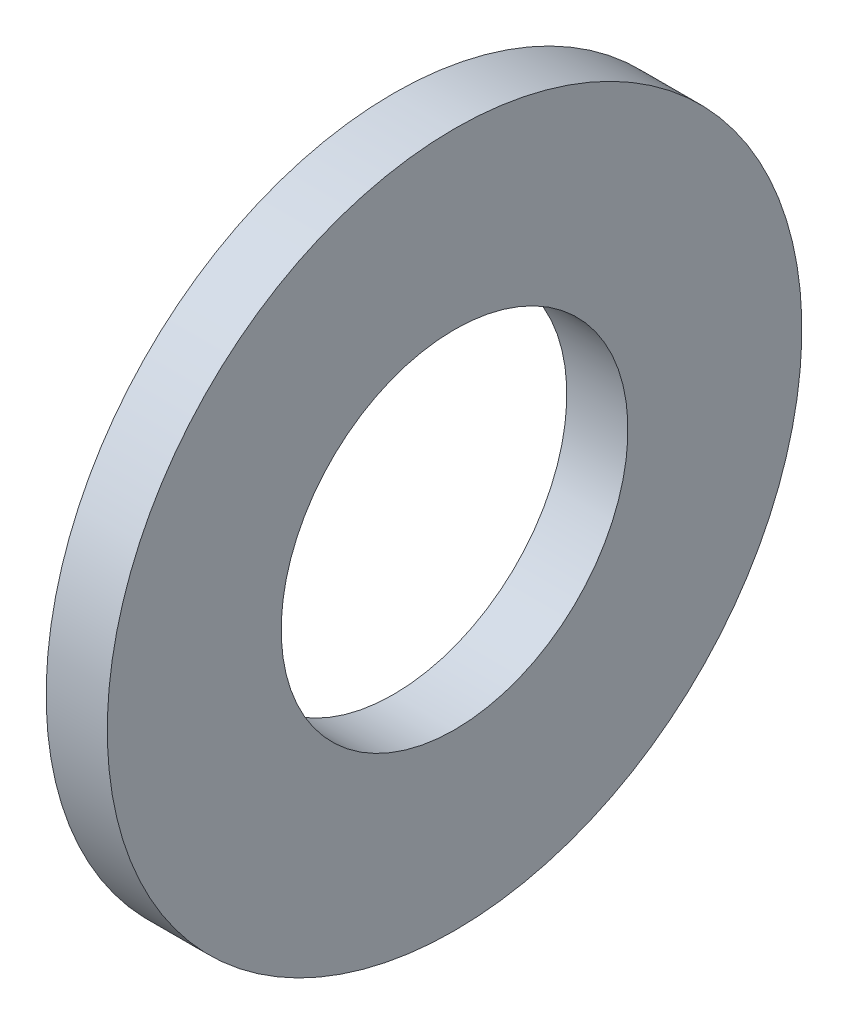
ISO-10303-21;
HEADER;
FILE_DESCRIPTION(('STEP AP214'),'2;1');
FILE_NAME('part.step','',(''),(''),'','','');
FILE_SCHEMA(('AUTOMOTIVE_DESIGN { 1 0 10303 214 1 1 1 1 }'));
ENDSEC;
DATA;
#1=APPLICATION_CONTEXT('core data for automotive mechanical design processes');
#2=APPLICATION_PROTOCOL_DEFINITION('international standard','automotive_design',2000,#1);
#3=PRODUCT_CONTEXT('',#1,'mechanical');
#4=PRODUCT('Part','Part','',(#3));
#5=PRODUCT_RELATED_PRODUCT_CATEGORY('part','',(#4));
#6=PRODUCT_DEFINITION_FORMATION('','',#4);
#7=PRODUCT_DEFINITION_CONTEXT('part definition',#1,'design');
#8=PRODUCT_DEFINITION('design','',#6,#7);
#9=PRODUCT_DEFINITION_SHAPE('','',#8);
#10=(LENGTH_UNIT() NAMED_UNIT(*) SI_UNIT(.MILLI.,.METRE.));
#11=(NAMED_UNIT(*) PLANE_ANGLE_UNIT() SI_UNIT($,.RADIAN.));
#12=(NAMED_UNIT(*) SI_UNIT($,.STERADIAN.) SOLID_ANGLE_UNIT());
#13=UNCERTAINTY_MEASURE_WITH_UNIT(LENGTH_MEASURE(1.E-05),#10,'distance_accuracy_value','');
#14=(GEOMETRIC_REPRESENTATION_CONTEXT(3) GLOBAL_UNCERTAINTY_ASSIGNED_CONTEXT((#13)) GLOBAL_UNIT_ASSIGNED_CONTEXT((#10,
#11,#12)) REPRESENTATION_CONTEXT('',''));
#15=CARTESIAN_POINT('',(0.,0.,0.));
#16=DIRECTION('',(0.,0.,1.));
#17=DIRECTION('',(1.,0.,0.));
#18=AXIS2_PLACEMENT_3D('',#15,#16,#17);
#19=CARTESIAN_POINT('',(0.,3.9624,0.));
#20=DIRECTION('',(-1.,0.,0.));
#21=DIRECTION('',(0.,-1.,0.));
#22=AXIS2_PLACEMENT_3D('',#19,#20,#21);
#23=PLANE('',#22);
#24=CARTESIAN_POINT('',(0.,0.,0.));
#25=DIRECTION('',(-1.,0.,0.));
#26=DIRECTION('',(0.,-1.,0.));
#27=AXIS2_PLACEMENT_3D('',#24,#25,#26);
#28=CIRCLE('',#27,3.9624);
#29=CARTESIAN_POINT('',(0.,-3.96240000000001,0.));
#30=VERTEX_POINT('',#29);
#31=EDGE_CURVE('E17',#30,#30,#28,.T.);
#32=ORIENTED_EDGE('',*,*,#31,.T.);
#33=EDGE_LOOP('',(#32));
#34=FACE_BOUND('',#33,.T.);
#35=CARTESIAN_POINT('',(0.,0.,0.));
#36=DIRECTION('',(-1.,0.,0.));
#37=DIRECTION('',(0.,-1.,0.));
#38=AXIS2_PLACEMENT_3D('',#35,#36,#37);
#39=CIRCLE('',#38,7.9375);
#40=CARTESIAN_POINT('',(0.,-7.93750000000001,0.));
#41=VERTEX_POINT('',#40);
#42=EDGE_CURVE('E26',#41,#41,#39,.T.);
#43=ORIENTED_EDGE('',*,*,#42,.F.);
#44=EDGE_LOOP('',(#43));
#45=FACE_BOUND('',#44,.T.);
#46=ADVANCED_FACE('F14',(#34,#45),#23,.F.);
#47=CARTESIAN_POINT('',(-34.925,0.,0.));
#48=DIRECTION('',(-1.,0.,0.));
#49=DIRECTION('',(0.,-1.,0.));
#50=AXIS2_PLACEMENT_3D('',#47,#48,#49);
#51=CYLINDRICAL_SURFACE('',#50,3.9624);
#52=ORIENTED_EDGE('',*,*,#31,.F.);
#53=EDGE_LOOP('',(#52));
#54=FACE_BOUND('',#53,.T.);
#55=CARTESIAN_POINT('',(-1.39700000000001,0.,0.));
#56=DIRECTION('',(-1.,0.,0.));
#57=DIRECTION('',(0.,-1.,0.));
#58=AXIS2_PLACEMENT_3D('',#55,#56,#57);
#59=CIRCLE('',#58,3.9624);
#60=CARTESIAN_POINT('',(-1.39700000000001,-3.96240000000001,0.));
#61=VERTEX_POINT('',#60);
#62=EDGE_CURVE('E21',#61,#61,#59,.T.);
#63=ORIENTED_EDGE('',*,*,#62,.T.);
#64=EDGE_LOOP('',(#63));
#65=FACE_BOUND('',#64,.T.);
#66=ADVANCED_FACE('F36',(#54,#65),#51,.F.);
#67=CARTESIAN_POINT('',(-34.925,0.,0.));
#68=DIRECTION('',(-1.,0.,0.));
#69=DIRECTION('',(0.,-1.,0.));
#70=AXIS2_PLACEMENT_3D('',#67,#68,#69);
#71=CYLINDRICAL_SURFACE('',#70,7.9375);
#72=CARTESIAN_POINT('',(-1.39700000000001,0.,0.));
#73=DIRECTION('',(-1.,0.,0.));
#74=DIRECTION('',(0.,-1.,0.));
#75=AXIS2_PLACEMENT_3D('',#72,#73,#74);
#76=CIRCLE('',#75,7.9375);
#77=CARTESIAN_POINT('',(-1.39700000000001,-7.93750000000001,0.));
#78=VERTEX_POINT('',#77);
#79=EDGE_CURVE('E10',#78,#78,#76,.F.);
#80=ORIENTED_EDGE('',*,*,#79,.T.);
#81=EDGE_LOOP('',(#80));
#82=FACE_BOUND('',#81,.T.);
#83=ORIENTED_EDGE('',*,*,#42,.T.);
#84=EDGE_LOOP('',(#83));
#85=FACE_BOUND('',#84,.T.);
#86=ADVANCED_FACE('F39',(#82,#85),#71,.T.);
#87=CARTESIAN_POINT('',(-1.397,7.9375,0.));
#88=DIRECTION('',(1.,0.,0.));
#89=DIRECTION('',(0.,1.,0.));
#90=AXIS2_PLACEMENT_3D('',#87,#88,#89);
#91=PLANE('',#90);
#92=ORIENTED_EDGE('',*,*,#79,.F.);
#93=EDGE_LOOP('',(#92));
#94=FACE_BOUND('',#93,.T.);
#95=ORIENTED_EDGE('',*,*,#62,.F.);
#96=EDGE_LOOP('',(#95));
#97=FACE_BOUND('',#96,.T.);
#98=ADVANCED_FACE('F42',(#94,#97),#91,.F.);
#99=CLOSED_SHELL('',(#46,#66,#86,#98));
#100=MANIFOLD_SOLID_BREP('B1',#99);
#101=ADVANCED_BREP_SHAPE_REPRESENTATION('',(#18,#100),#14);
#102=SHAPE_DEFINITION_REPRESENTATION(#9,#101);
ENDSEC;
END-ISO-10303-21;
